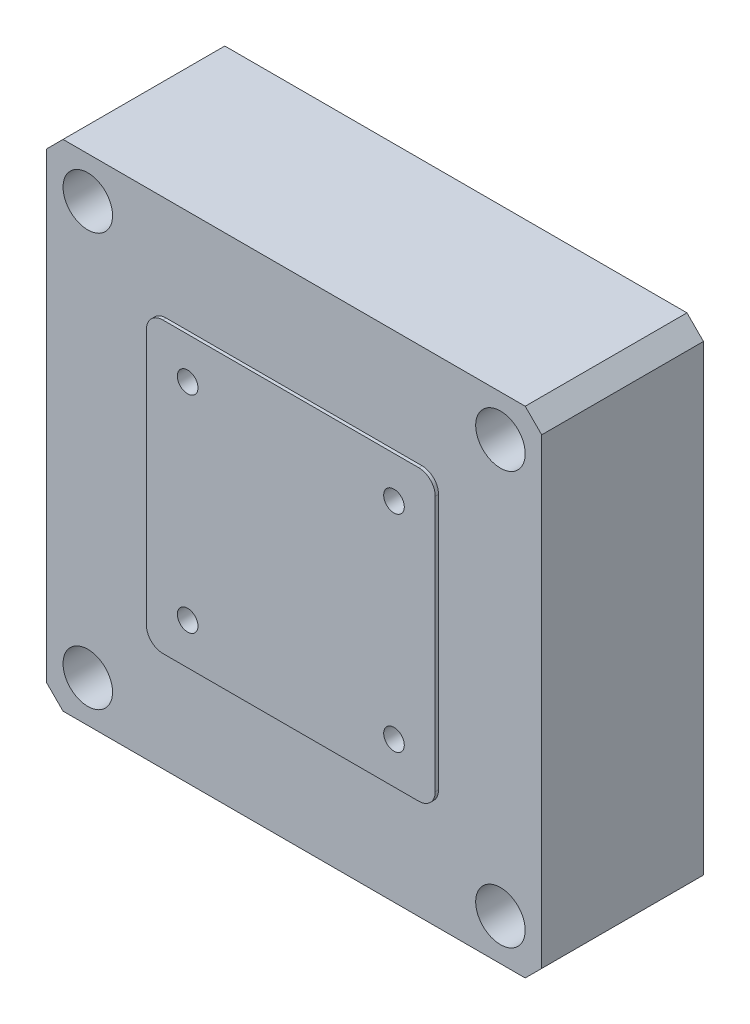
ISO-10303-21;
HEADER;
FILE_DESCRIPTION(('STEP AP214'),'2;1');
FILE_NAME('part.step','',(''),(''),'','','');
FILE_SCHEMA(('AUTOMOTIVE_DESIGN { 1 0 10303 214 1 1 1 1 }'));
ENDSEC;
DATA;
#1=APPLICATION_CONTEXT('core data for automotive mechanical design processes');
#2=APPLICATION_PROTOCOL_DEFINITION('international standard','automotive_design',2000,#1);
#3=PRODUCT_CONTEXT('',#1,'mechanical');
#4=PRODUCT('Part','Part','',(#3));
#5=PRODUCT_RELATED_PRODUCT_CATEGORY('part','',(#4));
#6=PRODUCT_DEFINITION_FORMATION('','',#4);
#7=PRODUCT_DEFINITION_CONTEXT('part definition',#1,'design');
#8=PRODUCT_DEFINITION('design','',#6,#7);
#9=PRODUCT_DEFINITION_SHAPE('','',#8);
#10=(LENGTH_UNIT() NAMED_UNIT(*) SI_UNIT(.MILLI.,.METRE.));
#11=(NAMED_UNIT(*) PLANE_ANGLE_UNIT() SI_UNIT($,.RADIAN.));
#12=(NAMED_UNIT(*) SI_UNIT($,.STERADIAN.) SOLID_ANGLE_UNIT());
#13=UNCERTAINTY_MEASURE_WITH_UNIT(LENGTH_MEASURE(1.E-05),#10,'distance_accuracy_value','');
#14=(GEOMETRIC_REPRESENTATION_CONTEXT(3) GLOBAL_UNCERTAINTY_ASSIGNED_CONTEXT((#13)) GLOBAL_UNIT_ASSIGNED_CONTEXT((#10,
#11,#12)) REPRESENTATION_CONTEXT('',''));
#15=CARTESIAN_POINT('',(0.,0.,0.));
#16=DIRECTION('',(0.,0.,1.));
#17=DIRECTION('',(1.,0.,0.));
#18=AXIS2_PLACEMENT_3D('',#15,#16,#17);
#19=CARTESIAN_POINT('',(30.,30.,19.6));
#20=DIRECTION('',(-1.,0.,0.));
#21=DIRECTION('',(0.,-1.,0.));
#22=AXIS2_PLACEMENT_3D('',#19,#20,#21);
#23=PLANE('',#22);
#24=DIRECTION('',(0.,1.,0.));
#25=VECTOR('',#24,1.);
#26=CARTESIAN_POINT('',(30.,30.,19.6));
#27=LINE('',#26,#25);
#28=CARTESIAN_POINT('',(30.,-28.,19.6));
#29=VERTEX_POINT('',#28);
#30=CARTESIAN_POINT('',(30.,28.,19.6));
#31=VERTEX_POINT('',#30);
#32=EDGE_CURVE('E301',#29,#31,#27,.T.);
#33=ORIENTED_EDGE('',*,*,#32,.F.);
#34=DIRECTION('',(0.,0.,-1.));
#35=VECTOR('',#34,1.);
#36=CARTESIAN_POINT('',(30.,-28.,19.6));
#37=LINE('',#36,#35);
#38=CARTESIAN_POINT('',(30.,-28.,0.));
#39=VERTEX_POINT('',#38);
#40=EDGE_CURVE('E373',#29,#39,#37,.T.);
#41=ORIENTED_EDGE('',*,*,#40,.T.);
#42=DIRECTION('',(0.,1.,0.));
#43=VECTOR('',#42,1.);
#44=CARTESIAN_POINT('',(30.,30.,0.));
#45=LINE('',#44,#43);
#46=CARTESIAN_POINT('',(30.,28.,0.));
#47=VERTEX_POINT('',#46);
#48=EDGE_CURVE('E287',#39,#47,#45,.T.);
#49=ORIENTED_EDGE('',*,*,#48,.T.);
#50=DIRECTION('',(0.,0.,1.));
#51=VECTOR('',#50,1.);
#52=CARTESIAN_POINT('',(30.,28.,19.6));
#53=LINE('',#52,#51);
#54=EDGE_CURVE('E370',#47,#31,#53,.T.);
#55=ORIENTED_EDGE('',*,*,#54,.T.);
#56=EDGE_LOOP('',(#33,#41,#49,#55));
#57=FACE_BOUND('',#56,.T.);
#58=ADVANCED_FACE('F41',(#57),#23,.F.);
#59=CARTESIAN_POINT('',(-30.,30.,19.6));
#60=DIRECTION('',(0.,-1.,0.));
#61=DIRECTION('',(0.,0.,-1.));
#62=AXIS2_PLACEMENT_3D('',#59,#60,#61);
#63=PLANE('',#62);
#64=DIRECTION('',(-1.,0.,0.));
#65=VECTOR('',#64,1.);
#66=CARTESIAN_POINT('',(-30.,30.,19.6));
#67=LINE('',#66,#65);
#68=CARTESIAN_POINT('',(28.,30.,19.6));
#69=VERTEX_POINT('',#68);
#70=CARTESIAN_POINT('',(-28.,30.,19.6));
#71=VERTEX_POINT('',#70);
#72=EDGE_CURVE('E305',#69,#71,#67,.T.);
#73=ORIENTED_EDGE('',*,*,#72,.F.);
#74=DIRECTION('',(0.,0.,-1.));
#75=VECTOR('',#74,1.);
#76=CARTESIAN_POINT('',(28.,30.,19.6));
#77=LINE('',#76,#75);
#78=CARTESIAN_POINT('',(28.,30.,0.));
#79=VERTEX_POINT('',#78);
#80=EDGE_CURVE('E380',#69,#79,#77,.T.);
#81=ORIENTED_EDGE('',*,*,#80,.T.);
#82=DIRECTION('',(-1.,0.,0.));
#83=VECTOR('',#82,1.);
#84=CARTESIAN_POINT('',(-30.,30.,0.));
#85=LINE('',#84,#83);
#86=CARTESIAN_POINT('',(-28.,30.,0.));
#87=VERTEX_POINT('',#86);
#88=EDGE_CURVE('E322',#79,#87,#85,.T.);
#89=ORIENTED_EDGE('',*,*,#88,.T.);
#90=DIRECTION('',(0.,0.,1.));
#91=VECTOR('',#90,1.);
#92=CARTESIAN_POINT('',(-28.,30.,19.6));
#93=LINE('',#92,#91);
#94=EDGE_CURVE('E377',#87,#71,#93,.T.);
#95=ORIENTED_EDGE('',*,*,#94,.T.);
#96=EDGE_LOOP('',(#73,#81,#89,#95));
#97=FACE_BOUND('',#96,.T.);
#98=ADVANCED_FACE('F474',(#97),#63,.F.);
#99=CARTESIAN_POINT('',(-30.,30.,19.6));
#100=DIRECTION('',(1.,0.,0.));
#101=DIRECTION('',(0.,1.,0.));
#102=AXIS2_PLACEMENT_3D('',#99,#100,#101);
#103=PLANE('',#102);
#104=DIRECTION('',(0.,-1.,0.));
#105=VECTOR('',#104,1.);
#106=CARTESIAN_POINT('',(-30.,30.,0.));
#107=LINE('',#106,#105);
#108=CARTESIAN_POINT('',(-30.,28.,0.));
#109=VERTEX_POINT('',#108);
#110=CARTESIAN_POINT('',(-30.,-28.,0.));
#111=VERTEX_POINT('',#110);
#112=EDGE_CURVE('E326',#109,#111,#107,.T.);
#113=ORIENTED_EDGE('',*,*,#112,.T.);
#114=DIRECTION('',(0.,0.,1.));
#115=VECTOR('',#114,1.);
#116=CARTESIAN_POINT('',(-30.,-28.,19.6));
#117=LINE('',#116,#115);
#118=CARTESIAN_POINT('',(-30.,-28.,19.6));
#119=VERTEX_POINT('',#118);
#120=EDGE_CURVE('E355',#111,#119,#117,.T.);
#121=ORIENTED_EDGE('',*,*,#120,.T.);
#122=DIRECTION('',(0.,-1.,0.));
#123=VECTOR('',#122,1.);
#124=CARTESIAN_POINT('',(-30.,30.,19.6));
#125=LINE('',#124,#123);
#126=CARTESIAN_POINT('',(-30.,28.,19.6));
#127=VERTEX_POINT('',#126);
#128=EDGE_CURVE('E310',#127,#119,#125,.T.);
#129=ORIENTED_EDGE('',*,*,#128,.F.);
#130=DIRECTION('',(0.,0.,-1.));
#131=VECTOR('',#130,1.);
#132=CARTESIAN_POINT('',(-30.,28.,19.6));
#133=LINE('',#132,#131);
#134=EDGE_CURVE('E351',#127,#109,#133,.T.);
#135=ORIENTED_EDGE('',*,*,#134,.T.);
#136=EDGE_LOOP('',(#113,#121,#129,#135));
#137=FACE_BOUND('',#136,.T.);
#138=ADVANCED_FACE('F480',(#137),#103,.F.);
#139=CARTESIAN_POINT('',(-30.,-30.,19.6));
#140=DIRECTION('',(0.,1.,0.));
#141=DIRECTION('',(0.,0.,1.));
#142=AXIS2_PLACEMENT_3D('',#139,#140,#141);
#143=PLANE('',#142);
#144=DIRECTION('',(1.,0.,0.));
#145=VECTOR('',#144,1.);
#146=CARTESIAN_POINT('',(-30.,-30.,19.6));
#147=LINE('',#146,#145);
#148=CARTESIAN_POINT('',(-28.,-30.,19.6));
#149=VERTEX_POINT('',#148);
#150=CARTESIAN_POINT('',(28.,-30.,19.6));
#151=VERTEX_POINT('',#150);
#152=EDGE_CURVE('E314',#149,#151,#147,.T.);
#153=ORIENTED_EDGE('',*,*,#152,.F.);
#154=DIRECTION('',(0.,0.,-1.));
#155=VECTOR('',#154,1.);
#156=CARTESIAN_POINT('',(-28.,-30.,19.6));
#157=LINE('',#156,#155);
#158=CARTESIAN_POINT('',(-28.,-30.,0.));
#159=VERTEX_POINT('',#158);
#160=EDGE_CURVE('E335',#149,#159,#157,.T.);
#161=ORIENTED_EDGE('',*,*,#160,.T.);
#162=DIRECTION('',(1.,0.,0.));
#163=VECTOR('',#162,1.);
#164=CARTESIAN_POINT('',(-30.,-30.,0.));
#165=LINE('',#164,#163);
#166=CARTESIAN_POINT('',(28.,-30.,0.));
#167=VERTEX_POINT('',#166);
#168=EDGE_CURVE('E306',#159,#167,#165,.T.);
#169=ORIENTED_EDGE('',*,*,#168,.T.);
#170=DIRECTION('',(0.,0.,1.));
#171=VECTOR('',#170,1.);
#172=CARTESIAN_POINT('',(28.,-30.,19.6));
#173=LINE('',#172,#171);
#174=EDGE_CURVE('E318',#167,#151,#173,.T.);
#175=ORIENTED_EDGE('',*,*,#174,.T.);
#176=EDGE_LOOP('',(#153,#161,#169,#175));
#177=FACE_BOUND('',#176,.T.);
#178=ADVANCED_FACE('F518',(#177),#143,.F.);
#179=CARTESIAN_POINT('',(0.,0.,19.6));
#180=DIRECTION('',(0.,0.,1.));
#181=DIRECTION('',(1.,0.,0.));
#182=AXIS2_PLACEMENT_3D('',#179,#180,#181);
#183=PLANE('',#182);
#184=CARTESIAN_POINT('',(-25.,25.,19.6));
#185=DIRECTION('',(0.,0.,1.));
#186=DIRECTION('',(1.,0.,0.));
#187=AXIS2_PLACEMENT_3D('',#184,#185,#186);
#188=CIRCLE('',#187,3.00000000000001);
#189=CARTESIAN_POINT('',(-22.,25.,19.6));
#190=VERTEX_POINT('',#189);
#191=EDGE_CURVE('E205',#190,#190,#188,.T.);
#192=ORIENTED_EDGE('',*,*,#191,.F.);
#193=EDGE_LOOP('',(#192));
#194=FACE_BOUND('',#193,.T.);
#195=CARTESIAN_POINT('',(25.,25.,19.6));
#196=DIRECTION('',(0.,0.,1.));
#197=DIRECTION('',(1.,0.,0.));
#198=AXIS2_PLACEMENT_3D('',#195,#196,#197);
#199=CIRCLE('',#198,3.00000000000001);
#200=CARTESIAN_POINT('',(28.,25.,19.6));
#201=VERTEX_POINT('',#200);
#202=EDGE_CURVE('E221',#201,#201,#199,.T.);
#203=ORIENTED_EDGE('',*,*,#202,.F.);
#204=EDGE_LOOP('',(#203));
#205=FACE_BOUND('',#204,.T.);
#206=CARTESIAN_POINT('',(-25.,-25.,19.6));
#207=DIRECTION('',(0.,0.,1.));
#208=DIRECTION('',(1.,0.,0.));
#209=AXIS2_PLACEMENT_3D('',#206,#207,#208);
#210=CIRCLE('',#209,3.00000000000001);
#211=CARTESIAN_POINT('',(-22.,-25.,19.6));
#212=VERTEX_POINT('',#211);
#213=EDGE_CURVE('E237',#212,#212,#210,.T.);
#214=ORIENTED_EDGE('',*,*,#213,.F.);
#215=EDGE_LOOP('',(#214));
#216=FACE_BOUND('',#215,.T.);
#217=CARTESIAN_POINT('',(25.,-25.,19.6));
#218=DIRECTION('',(0.,0.,1.));
#219=DIRECTION('',(1.,0.,0.));
#220=AXIS2_PLACEMENT_3D('',#217,#218,#219);
#221=CIRCLE('',#220,3.00000000000001);
#222=CARTESIAN_POINT('',(28.,-25.,19.6));
#223=VERTEX_POINT('',#222);
#224=EDGE_CURVE('E253',#223,#223,#221,.T.);
#225=ORIENTED_EDGE('',*,*,#224,.F.);
#226=EDGE_LOOP('',(#225));
#227=FACE_BOUND('',#226,.T.);
#228=DIRECTION('',(0.,1.,0.));
#229=VECTOR('',#228,1.);
#230=CARTESIAN_POINT('',(17.5,17.5,19.6));
#231=LINE('',#230,#229);
#232=CARTESIAN_POINT('',(17.5,-15.5,19.6));
#233=VERTEX_POINT('',#232);
#234=CARTESIAN_POINT('',(17.5,15.5,19.6));
#235=VERTEX_POINT('',#234);
#236=EDGE_CURVE('E269',#233,#235,#231,.T.);
#237=ORIENTED_EDGE('',*,*,#236,.F.);
#238=CARTESIAN_POINT('',(15.5,-15.5,19.6));
#239=DIRECTION('',(0.,0.,1.));
#240=DIRECTION('',(1.,0.,0.));
#241=AXIS2_PLACEMENT_3D('',#238,#239,#240);
#242=CIRCLE('',#241,2.);
#243=CARTESIAN_POINT('',(15.5,-17.5,19.6));
#244=VERTEX_POINT('',#243);
#245=EDGE_CURVE('E423',#233,#244,#242,.F.);
#246=ORIENTED_EDGE('',*,*,#245,.T.);
#247=DIRECTION('',(1.,0.,0.));
#248=VECTOR('',#247,1.);
#249=CARTESIAN_POINT('',(-17.5,-17.5,19.6));
#250=LINE('',#249,#248);
#251=CARTESIAN_POINT('',(-15.5,-17.5,19.6));
#252=VERTEX_POINT('',#251);
#253=EDGE_CURVE('E275',#252,#244,#250,.T.);
#254=ORIENTED_EDGE('',*,*,#253,.F.);
#255=CARTESIAN_POINT('',(-15.5,-15.5,19.6));
#256=DIRECTION('',(0.,0.,1.));
#257=DIRECTION('',(1.,0.,0.));
#258=AXIS2_PLACEMENT_3D('',#255,#256,#257);
#259=CIRCLE('',#258,2.);
#260=CARTESIAN_POINT('',(-17.5,-15.5,19.6));
#261=VERTEX_POINT('',#260);
#262=EDGE_CURVE('E426',#252,#261,#259,.F.);
#263=ORIENTED_EDGE('',*,*,#262,.T.);
#264=DIRECTION('',(0.,-1.,0.));
#265=VECTOR('',#264,1.);
#266=CARTESIAN_POINT('',(-17.5,17.5,19.6));
#267=LINE('',#266,#265);
#268=CARTESIAN_POINT('',(-17.5,15.5,19.6));
#269=VERTEX_POINT('',#268);
#270=EDGE_CURVE('E294',#269,#261,#267,.T.);
#271=ORIENTED_EDGE('',*,*,#270,.F.);
#272=CARTESIAN_POINT('',(-15.5,15.5,19.6));
#273=DIRECTION('',(0.,0.,1.));
#274=DIRECTION('',(1.,0.,0.));
#275=AXIS2_PLACEMENT_3D('',#272,#273,#274);
#276=CIRCLE('',#275,2.);
#277=CARTESIAN_POINT('',(-15.5,17.5,19.6));
#278=VERTEX_POINT('',#277);
#279=EDGE_CURVE('E11',#269,#278,#276,.F.);
#280=ORIENTED_EDGE('',*,*,#279,.T.);
#281=DIRECTION('',(-1.,0.,0.));
#282=VECTOR('',#281,1.);
#283=CARTESIAN_POINT('',(-17.5,17.5,19.6));
#284=LINE('',#283,#282);
#285=CARTESIAN_POINT('',(15.5,17.5,19.6));
#286=VERTEX_POINT('',#285);
#287=EDGE_CURVE('E291',#286,#278,#284,.T.);
#288=ORIENTED_EDGE('',*,*,#287,.F.);
#289=CARTESIAN_POINT('',(15.5,15.5,19.6));
#290=DIRECTION('',(0.,0.,1.));
#291=DIRECTION('',(1.,0.,0.));
#292=AXIS2_PLACEMENT_3D('',#289,#290,#291);
#293=CIRCLE('',#292,2.);
#294=EDGE_CURVE('E50',#286,#235,#293,.F.);
#295=ORIENTED_EDGE('',*,*,#294,.T.);
#296=EDGE_LOOP('',(#237,#246,#254,#263,#271,#280,#288,#295));
#297=FACE_BOUND('',#296,.T.);
#298=ORIENTED_EDGE('',*,*,#128,.T.);
#299=DIRECTION('',(-0.707106781186545,0.70710678118655,0.));
#300=VECTOR('',#299,1.);
#301=CARTESIAN_POINT('',(-29.0000000000001,-28.9999999999999,19.6));
#302=LINE('',#301,#300);
#303=EDGE_CURVE('E367',#119,#149,#302,.F.);
#304=ORIENTED_EDGE('',*,*,#303,.T.);
#305=ORIENTED_EDGE('',*,*,#152,.T.);
#306=DIRECTION('',(-0.707106781186548,-0.707106781186547,0.));
#307=VECTOR('',#306,1.);
#308=CARTESIAN_POINT('',(29.,-29.,19.6));
#309=LINE('',#308,#307);
#310=EDGE_CURVE('E364',#151,#29,#309,.F.);
#311=ORIENTED_EDGE('',*,*,#310,.T.);
#312=ORIENTED_EDGE('',*,*,#32,.T.);
#313=DIRECTION('',(0.707106781186545,-0.70710678118655,0.));
#314=VECTOR('',#313,1.);
#315=CARTESIAN_POINT('',(29.0000000000001,28.9999999999999,19.6));
#316=LINE('',#315,#314);
#317=EDGE_CURVE('E361',#31,#69,#316,.F.);
#318=ORIENTED_EDGE('',*,*,#317,.T.);
#319=ORIENTED_EDGE('',*,*,#72,.T.);
#320=DIRECTION('',(0.70710678118655,0.707106781186545,0.));
#321=VECTOR('',#320,1.);
#322=CARTESIAN_POINT('',(-28.9999999999999,29.0000000000001,19.6));
#323=LINE('',#322,#321);
#324=EDGE_CURVE('E358',#71,#127,#323,.F.);
#325=ORIENTED_EDGE('',*,*,#324,.T.);
#326=EDGE_LOOP('',(#298,#304,#305,#311,#312,#318,#319,#325));
#327=FACE_BOUND('',#326,.T.);
#328=ADVANCED_FACE('F430',(#194,#205,#216,#227,#297,#327),#183,.T.);
#329=CARTESIAN_POINT('',(0.,0.,0.));
#330=DIRECTION('',(0.,0.,1.));
#331=DIRECTION('',(1.,0.,0.));
#332=AXIS2_PLACEMENT_3D('',#329,#330,#331);
#333=PLANE('',#332);
#334=CARTESIAN_POINT('',(-25.,25.,0.));
#335=DIRECTION('',(0.,0.,1.));
#336=DIRECTION('',(1.,0.,0.));
#337=AXIS2_PLACEMENT_3D('',#334,#335,#336);
#338=CIRCLE('',#337,1.70000000000001);
#339=CARTESIAN_POINT('',(-23.3,25.,0.));
#340=VERTEX_POINT('',#339);
#341=EDGE_CURVE('E217',#340,#340,#338,.T.);
#342=ORIENTED_EDGE('',*,*,#341,.T.);
#343=EDGE_LOOP('',(#342));
#344=FACE_BOUND('',#343,.T.);
#345=CARTESIAN_POINT('',(25.,25.,0.));
#346=DIRECTION('',(0.,0.,1.));
#347=DIRECTION('',(1.,0.,0.));
#348=AXIS2_PLACEMENT_3D('',#345,#346,#347);
#349=CIRCLE('',#348,1.70000000000001);
#350=CARTESIAN_POINT('',(26.7,25.,0.));
#351=VERTEX_POINT('',#350);
#352=EDGE_CURVE('E233',#351,#351,#349,.T.);
#353=ORIENTED_EDGE('',*,*,#352,.T.);
#354=EDGE_LOOP('',(#353));
#355=FACE_BOUND('',#354,.T.);
#356=CARTESIAN_POINT('',(-25.,-25.,0.));
#357=DIRECTION('',(0.,0.,1.));
#358=DIRECTION('',(1.,0.,0.));
#359=AXIS2_PLACEMENT_3D('',#356,#357,#358);
#360=CIRCLE('',#359,1.70000000000001);
#361=CARTESIAN_POINT('',(-23.3,-25.,0.));
#362=VERTEX_POINT('',#361);
#363=EDGE_CURVE('E249',#362,#362,#360,.T.);
#364=ORIENTED_EDGE('',*,*,#363,.T.);
#365=EDGE_LOOP('',(#364));
#366=FACE_BOUND('',#365,.T.);
#367=CARTESIAN_POINT('',(25.,-25.,0.));
#368=DIRECTION('',(0.,0.,1.));
#369=DIRECTION('',(1.,0.,0.));
#370=AXIS2_PLACEMENT_3D('',#367,#368,#369);
#371=CIRCLE('',#370,1.70000000000001);
#372=CARTESIAN_POINT('',(26.7,-25.,0.));
#373=VERTEX_POINT('',#372);
#374=EDGE_CURVE('E265',#373,#373,#371,.T.);
#375=ORIENTED_EDGE('',*,*,#374,.T.);
#376=EDGE_LOOP('',(#375));
#377=FACE_BOUND('',#376,.T.);
#378=ORIENTED_EDGE('',*,*,#168,.F.);
#379=DIRECTION('',(0.707106781186545,-0.70710678118655,0.));
#380=VECTOR('',#379,1.);
#381=CARTESIAN_POINT('',(-28.,-30.,0.));
#382=LINE('',#381,#380);
#383=EDGE_CURVE('E348',#159,#111,#382,.F.);
#384=ORIENTED_EDGE('',*,*,#383,.T.);
#385=ORIENTED_EDGE('',*,*,#112,.F.);
#386=DIRECTION('',(-0.70710678118655,-0.707106781186545,0.));
#387=VECTOR('',#386,1.);
#388=CARTESIAN_POINT('',(-30.,28.,0.));
#389=LINE('',#388,#387);
#390=EDGE_CURVE('E339',#109,#87,#389,.F.);
#391=ORIENTED_EDGE('',*,*,#390,.T.);
#392=ORIENTED_EDGE('',*,*,#88,.F.);
#393=DIRECTION('',(-0.707106781186545,0.70710678118655,0.));
#394=VECTOR('',#393,1.);
#395=CARTESIAN_POINT('',(28.,30.,0.));
#396=LINE('',#395,#394);
#397=EDGE_CURVE('E342',#79,#47,#396,.F.);
#398=ORIENTED_EDGE('',*,*,#397,.T.);
#399=ORIENTED_EDGE('',*,*,#48,.F.);
#400=DIRECTION('',(0.707106781186548,0.707106781186547,0.));
#401=VECTOR('',#400,1.);
#402=CARTESIAN_POINT('',(30.,-28.,0.));
#403=LINE('',#402,#401);
#404=EDGE_CURVE('E345',#39,#167,#403,.F.);
#405=ORIENTED_EDGE('',*,*,#404,.T.);
#406=EDGE_LOOP('',(#378,#384,#385,#391,#392,#398,#399,#405));
#407=FACE_BOUND('',#406,.T.);
#408=ADVANCED_FACE('F490',(#344,#355,#366,#377,#407),#333,.F.);
#409=CARTESIAN_POINT('',(-28.,-30.,19.6));
#410=DIRECTION('',(0.70710678118655,0.707106781186545,0.));
#411=DIRECTION('',(0.,0.,-1.));
#412=AXIS2_PLACEMENT_3D('',#409,#410,#411);
#413=PLANE('',#412);
#414=ORIENTED_EDGE('',*,*,#303,.F.);
#415=ORIENTED_EDGE('',*,*,#120,.F.);
#416=ORIENTED_EDGE('',*,*,#383,.F.);
#417=ORIENTED_EDGE('',*,*,#160,.F.);
#418=EDGE_LOOP('',(#414,#415,#416,#417));
#419=FACE_BOUND('',#418,.T.);
#420=ADVANCED_FACE('F486',(#419),#413,.F.);
#421=CARTESIAN_POINT('',(30.,-28.,19.6));
#422=DIRECTION('',(-0.707106781186547,0.707106781186548,0.));
#423=DIRECTION('',(0.,0.,-1.));
#424=AXIS2_PLACEMENT_3D('',#421,#422,#423);
#425=PLANE('',#424);
#426=ORIENTED_EDGE('',*,*,#310,.F.);
#427=ORIENTED_EDGE('',*,*,#174,.F.);
#428=ORIENTED_EDGE('',*,*,#404,.F.);
#429=ORIENTED_EDGE('',*,*,#40,.F.);
#430=EDGE_LOOP('',(#426,#427,#428,#429));
#431=FACE_BOUND('',#430,.T.);
#432=ADVANCED_FACE('F489',(#431),#425,.F.);
#433=CARTESIAN_POINT('',(28.,30.,19.6));
#434=DIRECTION('',(-0.70710678118655,-0.707106781186545,0.));
#435=DIRECTION('',(0.,0.,-1.));
#436=AXIS2_PLACEMENT_3D('',#433,#434,#435);
#437=PLANE('',#436);
#438=ORIENTED_EDGE('',*,*,#317,.F.);
#439=ORIENTED_EDGE('',*,*,#54,.F.);
#440=ORIENTED_EDGE('',*,*,#397,.F.);
#441=ORIENTED_EDGE('',*,*,#80,.F.);
#442=EDGE_LOOP('',(#438,#439,#440,#441));
#443=FACE_BOUND('',#442,.T.);
#444=ADVANCED_FACE('F494',(#443),#437,.F.);
#445=CARTESIAN_POINT('',(-30.,28.,19.6));
#446=DIRECTION('',(0.707106781186545,-0.70710678118655,0.));
#447=DIRECTION('',(0.,0.,-1.));
#448=AXIS2_PLACEMENT_3D('',#445,#446,#447);
#449=PLANE('',#448);
#450=ORIENTED_EDGE('',*,*,#324,.F.);
#451=ORIENTED_EDGE('',*,*,#94,.F.);
#452=ORIENTED_EDGE('',*,*,#390,.F.);
#453=ORIENTED_EDGE('',*,*,#134,.F.);
#454=EDGE_LOOP('',(#450,#451,#452,#453));
#455=FACE_BOUND('',#454,.T.);
#456=ADVANCED_FACE('F497',(#455),#449,.F.);
#457=CARTESIAN_POINT('',(17.5,17.5,20.));
#458=DIRECTION('',(-1.,0.,0.));
#459=DIRECTION('',(0.,-1.,0.));
#460=AXIS2_PLACEMENT_3D('',#457,#458,#459);
#461=PLANE('',#460);
#462=DIRECTION('',(0.,1.,0.));
#463=VECTOR('',#462,1.);
#464=CARTESIAN_POINT('',(17.5,17.5,20.));
#465=LINE('',#464,#463);
#466=CARTESIAN_POINT('',(17.5,-15.5,20.));
#467=VERTEX_POINT('',#466);
#468=CARTESIAN_POINT('',(17.5,15.5,20.));
#469=VERTEX_POINT('',#468);
#470=EDGE_CURVE('E270',#467,#469,#465,.T.);
#471=ORIENTED_EDGE('',*,*,#470,.F.);
#472=DIRECTION('',(0.,0.,-1.));
#473=VECTOR('',#472,1.);
#474=CARTESIAN_POINT('',(17.5,-15.5,20.));
#475=LINE('',#474,#473);
#476=EDGE_CURVE('E387',#467,#233,#475,.T.);
#477=ORIENTED_EDGE('',*,*,#476,.T.);
#478=ORIENTED_EDGE('',*,*,#236,.T.);
#479=DIRECTION('',(0.,0.,-1.));
#480=VECTOR('',#479,1.);
#481=CARTESIAN_POINT('',(17.5,15.5,20.));
#482=LINE('',#481,#480);
#483=EDGE_CURVE('E384',#235,#469,#482,.F.);
#484=ORIENTED_EDGE('',*,*,#483,.T.);
#485=EDGE_LOOP('',(#471,#477,#478,#484));
#486=FACE_BOUND('',#485,.T.);
#487=ADVANCED_FACE('F434',(#486),#461,.F.);
#488=CARTESIAN_POINT('',(-17.5,17.5,20.));
#489=DIRECTION('',(0.,-1.,0.));
#490=DIRECTION('',(0.,0.,-1.));
#491=AXIS2_PLACEMENT_3D('',#488,#489,#490);
#492=PLANE('',#491);
#493=DIRECTION('',(-1.,0.,0.));
#494=VECTOR('',#493,1.);
#495=CARTESIAN_POINT('',(-17.5,17.5,20.));
#496=LINE('',#495,#494);
#497=CARTESIAN_POINT('',(15.5,17.5,20.));
#498=VERTEX_POINT('',#497);
#499=CARTESIAN_POINT('',(-15.5,17.5,20.));
#500=VERTEX_POINT('',#499);
#501=EDGE_CURVE('E274',#498,#500,#496,.T.);
#502=ORIENTED_EDGE('',*,*,#501,.F.);
#503=DIRECTION('',(0.,0.,-1.));
#504=VECTOR('',#503,1.);
#505=CARTESIAN_POINT('',(15.5,17.5,20.));
#506=LINE('',#505,#504);
#507=EDGE_CURVE('E420',#498,#286,#506,.T.);
#508=ORIENTED_EDGE('',*,*,#507,.T.);
#509=ORIENTED_EDGE('',*,*,#287,.T.);
#510=DIRECTION('',(0.,0.,-1.));
#511=VECTOR('',#510,1.);
#512=CARTESIAN_POINT('',(-15.5,17.5,20.));
#513=LINE('',#512,#511);
#514=EDGE_CURVE('E417',#278,#500,#513,.F.);
#515=ORIENTED_EDGE('',*,*,#514,.T.);
#516=EDGE_LOOP('',(#502,#508,#509,#515));
#517=FACE_BOUND('',#516,.T.);
#518=ADVANCED_FACE('F443',(#517),#492,.F.);
#519=CARTESIAN_POINT('',(-17.5,17.5,20.));
#520=DIRECTION('',(1.,0.,0.));
#521=DIRECTION('',(0.,1.,0.));
#522=AXIS2_PLACEMENT_3D('',#519,#520,#521);
#523=PLANE('',#522);
#524=ORIENTED_EDGE('',*,*,#270,.T.);
#525=DIRECTION('',(0.,0.,-1.));
#526=VECTOR('',#525,1.);
#527=CARTESIAN_POINT('',(-17.5,-15.5,20.));
#528=LINE('',#527,#526);
#529=CARTESIAN_POINT('',(-17.5,-15.5,20.));
#530=VERTEX_POINT('',#529);
#531=EDGE_CURVE('E414',#261,#530,#528,.F.);
#532=ORIENTED_EDGE('',*,*,#531,.T.);
#533=DIRECTION('',(0.,-1.,0.));
#534=VECTOR('',#533,1.);
#535=CARTESIAN_POINT('',(-17.5,17.5,20.));
#536=LINE('',#535,#534);
#537=CARTESIAN_POINT('',(-17.5,15.5,20.));
#538=VERTEX_POINT('',#537);
#539=EDGE_CURVE('E279',#538,#530,#536,.T.);
#540=ORIENTED_EDGE('',*,*,#539,.F.);
#541=DIRECTION('',(0.,0.,-1.));
#542=VECTOR('',#541,1.);
#543=CARTESIAN_POINT('',(-17.5,15.5,20.));
#544=LINE('',#543,#542);
#545=EDGE_CURVE('E410',#538,#269,#544,.T.);
#546=ORIENTED_EDGE('',*,*,#545,.T.);
#547=EDGE_LOOP('',(#524,#532,#540,#546));
#548=FACE_BOUND('',#547,.T.);
#549=ADVANCED_FACE('F450',(#548),#523,.F.);
#550=CARTESIAN_POINT('',(-17.5,-17.5,20.));
#551=DIRECTION('',(0.,1.,0.));
#552=DIRECTION('',(0.,0.,1.));
#553=AXIS2_PLACEMENT_3D('',#550,#551,#552);
#554=PLANE('',#553);
#555=ORIENTED_EDGE('',*,*,#253,.T.);
#556=DIRECTION('',(0.,0.,-1.));
#557=VECTOR('',#556,1.);
#558=CARTESIAN_POINT('',(15.5,-17.5,20.));
#559=LINE('',#558,#557);
#560=CARTESIAN_POINT('',(15.5,-17.5,20.));
#561=VERTEX_POINT('',#560);
#562=EDGE_CURVE('E395',#244,#561,#559,.F.);
#563=ORIENTED_EDGE('',*,*,#562,.T.);
#564=DIRECTION('',(1.,0.,0.));
#565=VECTOR('',#564,1.);
#566=CARTESIAN_POINT('',(-17.5,-17.5,20.));
#567=LINE('',#566,#565);
#568=CARTESIAN_POINT('',(-15.5,-17.5,20.));
#569=VERTEX_POINT('',#568);
#570=EDGE_CURVE('E283',#569,#561,#567,.T.);
#571=ORIENTED_EDGE('',*,*,#570,.F.);
#572=DIRECTION('',(0.,0.,-1.));
#573=VECTOR('',#572,1.);
#574=CARTESIAN_POINT('',(-15.5,-17.5,20.));
#575=LINE('',#574,#573);
#576=EDGE_CURVE('E391',#569,#252,#575,.T.);
#577=ORIENTED_EDGE('',*,*,#576,.T.);
#578=EDGE_LOOP('',(#555,#563,#571,#577));
#579=FACE_BOUND('',#578,.T.);
#580=ADVANCED_FACE('F458',(#579),#554,.F.);
#581=CARTESIAN_POINT('',(0.,0.,20.));
#582=DIRECTION('',(0.,0.,1.));
#583=DIRECTION('',(1.,0.,0.));
#584=AXIS2_PLACEMENT_3D('',#581,#582,#583);
#585=PLANE('',#584);
#586=CARTESIAN_POINT('',(-12.5,12.5,20.));
#587=DIRECTION('',(0.,0.,1.));
#588=DIRECTION('',(1.,0.,0.));
#589=AXIS2_PLACEMENT_3D('',#586,#587,#588);
#590=CIRCLE('',#589,1.25);
#591=CARTESIAN_POINT('',(-11.25,12.5,20.));
#592=VERTEX_POINT('',#591);
#593=EDGE_CURVE('E176',#592,#592,#590,.T.);
#594=ORIENTED_EDGE('',*,*,#593,.F.);
#595=EDGE_LOOP('',(#594));
#596=FACE_BOUND('',#595,.T.);
#597=CARTESIAN_POINT('',(12.5,12.5,20.));
#598=DIRECTION('',(0.,0.,1.));
#599=DIRECTION('',(1.,0.,0.));
#600=AXIS2_PLACEMENT_3D('',#597,#598,#599);
#601=CIRCLE('',#600,1.25);
#602=CARTESIAN_POINT('',(13.75,12.5,20.));
#603=VERTEX_POINT('',#602);
#604=EDGE_CURVE('E175',#603,#603,#601,.T.);
#605=ORIENTED_EDGE('',*,*,#604,.F.);
#606=EDGE_LOOP('',(#605));
#607=FACE_BOUND('',#606,.T.);
#608=CARTESIAN_POINT('',(12.5,-12.5,20.));
#609=DIRECTION('',(0.,0.,1.));
#610=DIRECTION('',(1.,0.,0.));
#611=AXIS2_PLACEMENT_3D('',#608,#609,#610);
#612=CIRCLE('',#611,1.25);
#613=CARTESIAN_POINT('',(13.75,-12.5,20.));
#614=VERTEX_POINT('',#613);
#615=EDGE_CURVE('E189',#614,#614,#612,.T.);
#616=ORIENTED_EDGE('',*,*,#615,.F.);
#617=EDGE_LOOP('',(#616));
#618=FACE_BOUND('',#617,.T.);
#619=CARTESIAN_POINT('',(-12.5,-12.5,20.));
#620=DIRECTION('',(0.,0.,1.));
#621=DIRECTION('',(1.,0.,0.));
#622=AXIS2_PLACEMENT_3D('',#619,#620,#621);
#623=CIRCLE('',#622,1.25);
#624=CARTESIAN_POINT('',(-11.25,-12.5,20.));
#625=VERTEX_POINT('',#624);
#626=EDGE_CURVE('E197',#625,#625,#623,.T.);
#627=ORIENTED_EDGE('',*,*,#626,.F.);
#628=EDGE_LOOP('',(#627));
#629=FACE_BOUND('',#628,.T.);
#630=ORIENTED_EDGE('',*,*,#570,.T.);
#631=CARTESIAN_POINT('',(15.5,-15.5,20.));
#632=DIRECTION('',(0.,0.,1.));
#633=DIRECTION('',(1.,0.,0.));
#634=AXIS2_PLACEMENT_3D('',#631,#632,#633);
#635=CIRCLE('',#634,2.);
#636=EDGE_CURVE('E407',#561,#467,#635,.T.);
#637=ORIENTED_EDGE('',*,*,#636,.T.);
#638=ORIENTED_EDGE('',*,*,#470,.T.);
#639=CARTESIAN_POINT('',(15.5,15.5,20.));
#640=DIRECTION('',(0.,0.,1.));
#641=DIRECTION('',(1.,0.,0.));
#642=AXIS2_PLACEMENT_3D('',#639,#640,#641);
#643=CIRCLE('',#642,2.);
#644=EDGE_CURVE('E401',#469,#498,#643,.T.);
#645=ORIENTED_EDGE('',*,*,#644,.T.);
#646=ORIENTED_EDGE('',*,*,#501,.T.);
#647=CARTESIAN_POINT('',(-15.5,15.5,20.));
#648=DIRECTION('',(0.,0.,1.));
#649=DIRECTION('',(1.,0.,0.));
#650=AXIS2_PLACEMENT_3D('',#647,#648,#649);
#651=CIRCLE('',#650,2.);
#652=EDGE_CURVE('E398',#500,#538,#651,.T.);
#653=ORIENTED_EDGE('',*,*,#652,.T.);
#654=ORIENTED_EDGE('',*,*,#539,.T.);
#655=CARTESIAN_POINT('',(-15.5,-15.5,20.));
#656=DIRECTION('',(0.,0.,1.));
#657=DIRECTION('',(1.,0.,0.));
#658=AXIS2_PLACEMENT_3D('',#655,#656,#657);
#659=CIRCLE('',#658,2.);
#660=EDGE_CURVE('E404',#530,#569,#659,.T.);
#661=ORIENTED_EDGE('',*,*,#660,.T.);
#662=EDGE_LOOP('',(#630,#637,#638,#645,#646,#653,#654,#661));
#663=FACE_BOUND('',#662,.T.);
#664=ADVANCED_FACE('F440',(#596,#607,#618,#629,#663),#585,.T.);
#665=CARTESIAN_POINT('',(15.5,-15.5,20.));
#666=DIRECTION('',(0.,0.,-1.));
#667=DIRECTION('',(-1.,0.,0.));
#668=AXIS2_PLACEMENT_3D('',#665,#666,#667);
#669=CYLINDRICAL_SURFACE('',#668,2.);
#670=ORIENTED_EDGE('',*,*,#636,.F.);
#671=ORIENTED_EDGE('',*,*,#562,.F.);
#672=ORIENTED_EDGE('',*,*,#245,.F.);
#673=ORIENTED_EDGE('',*,*,#476,.F.);
#674=EDGE_LOOP('',(#670,#671,#672,#673));
#675=FACE_BOUND('',#674,.T.);
#676=ADVANCED_FACE('F462',(#675),#669,.T.);
#677=CARTESIAN_POINT('',(-15.5,-15.5,20.));
#678=DIRECTION('',(0.,0.,-1.));
#679=DIRECTION('',(-1.,0.,0.));
#680=AXIS2_PLACEMENT_3D('',#677,#678,#679);
#681=CYLINDRICAL_SURFACE('',#680,2.);
#682=ORIENTED_EDGE('',*,*,#660,.F.);
#683=ORIENTED_EDGE('',*,*,#531,.F.);
#684=ORIENTED_EDGE('',*,*,#262,.F.);
#685=ORIENTED_EDGE('',*,*,#576,.F.);
#686=EDGE_LOOP('',(#682,#683,#684,#685));
#687=FACE_BOUND('',#686,.T.);
#688=ADVANCED_FACE('F453',(#687),#681,.T.);
#689=CARTESIAN_POINT('',(15.5,15.5,20.));
#690=DIRECTION('',(0.,0.,-1.));
#691=DIRECTION('',(-1.,0.,0.));
#692=AXIS2_PLACEMENT_3D('',#689,#690,#691);
#693=CYLINDRICAL_SURFACE('',#692,2.);
#694=ORIENTED_EDGE('',*,*,#644,.F.);
#695=ORIENTED_EDGE('',*,*,#483,.F.);
#696=ORIENTED_EDGE('',*,*,#294,.F.);
#697=ORIENTED_EDGE('',*,*,#507,.F.);
#698=EDGE_LOOP('',(#694,#695,#696,#697));
#699=FACE_BOUND('',#698,.T.);
#700=ADVANCED_FACE('F437',(#699),#693,.T.);
#701=CARTESIAN_POINT('',(-15.5,15.5,20.));
#702=DIRECTION('',(0.,0.,-1.));
#703=DIRECTION('',(-1.,0.,0.));
#704=AXIS2_PLACEMENT_3D('',#701,#702,#703);
#705=CYLINDRICAL_SURFACE('',#704,2.);
#706=ORIENTED_EDGE('',*,*,#652,.F.);
#707=ORIENTED_EDGE('',*,*,#514,.F.);
#708=ORIENTED_EDGE('',*,*,#279,.F.);
#709=ORIENTED_EDGE('',*,*,#545,.F.);
#710=EDGE_LOOP('',(#706,#707,#708,#709));
#711=FACE_BOUND('',#710,.T.);
#712=ADVANCED_FACE('F43',(#711),#705,.T.);
#713=CARTESIAN_POINT('',(25.,-25.,19.6));
#714=DIRECTION('',(0.,0.,1.));
#715=DIRECTION('',(1.,0.,0.));
#716=AXIS2_PLACEMENT_3D('',#713,#714,#715);
#717=CYLINDRICAL_SURFACE('',#716,1.70000000000001);
#718=ORIENTED_EDGE('',*,*,#374,.F.);
#719=EDGE_LOOP('',(#718));
#720=FACE_BOUND('',#719,.T.);
#721=CARTESIAN_POINT('',(25.,-25.,14.6));
#722=DIRECTION('',(0.,0.,1.));
#723=DIRECTION('',(1.,0.,0.));
#724=AXIS2_PLACEMENT_3D('',#721,#722,#723);
#725=CIRCLE('',#724,1.70000000000001);
#726=CARTESIAN_POINT('',(26.7,-25.,14.6));
#727=VERTEX_POINT('',#726);
#728=EDGE_CURVE('E261',#727,#727,#725,.T.);
#729=ORIENTED_EDGE('',*,*,#728,.T.);
#730=EDGE_LOOP('',(#729));
#731=FACE_BOUND('',#730,.T.);
#732=ADVANCED_FACE('F568',(#720,#731),#717,.F.);
#733=CARTESIAN_POINT('',(26.7,-25.,14.6));
#734=DIRECTION('',(0.,0.,-1.));
#735=DIRECTION('',(-1.,0.,0.));
#736=AXIS2_PLACEMENT_3D('',#733,#734,#735);
#737=PLANE('',#736);
#738=ORIENTED_EDGE('',*,*,#728,.F.);
#739=EDGE_LOOP('',(#738));
#740=FACE_BOUND('',#739,.T.);
#741=CARTESIAN_POINT('',(25.,-25.,14.6));
#742=DIRECTION('',(0.,0.,1.));
#743=DIRECTION('',(1.,0.,0.));
#744=AXIS2_PLACEMENT_3D('',#741,#742,#743);
#745=CIRCLE('',#744,3.00000000000001);
#746=CARTESIAN_POINT('',(28.,-25.,14.6));
#747=VERTEX_POINT('',#746);
#748=EDGE_CURVE('E257',#747,#747,#745,.T.);
#749=ORIENTED_EDGE('',*,*,#748,.T.);
#750=EDGE_LOOP('',(#749));
#751=FACE_BOUND('',#750,.T.);
#752=ADVANCED_FACE('F573',(#740,#751),#737,.F.);
#753=CARTESIAN_POINT('',(25.,-25.,19.6));
#754=DIRECTION('',(0.,0.,1.));
#755=DIRECTION('',(1.,0.,0.));
#756=AXIS2_PLACEMENT_3D('',#753,#754,#755);
#757=CYLINDRICAL_SURFACE('',#756,3.00000000000001);
#758=ORIENTED_EDGE('',*,*,#748,.F.);
#759=EDGE_LOOP('',(#758));
#760=FACE_BOUND('',#759,.T.);
#761=ORIENTED_EDGE('',*,*,#224,.T.);
#762=EDGE_LOOP('',(#761));
#763=FACE_BOUND('',#762,.T.);
#764=ADVANCED_FACE('F583',(#760,#763),#757,.F.);
#765=CARTESIAN_POINT('',(-25.,-25.,19.6));
#766=DIRECTION('',(0.,0.,1.));
#767=DIRECTION('',(1.,0.,0.));
#768=AXIS2_PLACEMENT_3D('',#765,#766,#767);
#769=CYLINDRICAL_SURFACE('',#768,1.70000000000001);
#770=ORIENTED_EDGE('',*,*,#363,.F.);
#771=EDGE_LOOP('',(#770));
#772=FACE_BOUND('',#771,.T.);
#773=CARTESIAN_POINT('',(-25.,-25.,14.6));
#774=DIRECTION('',(0.,0.,1.));
#775=DIRECTION('',(1.,0.,0.));
#776=AXIS2_PLACEMENT_3D('',#773,#774,#775);
#777=CIRCLE('',#776,1.70000000000001);
#778=CARTESIAN_POINT('',(-23.3,-25.,14.6));
#779=VERTEX_POINT('',#778);
#780=EDGE_CURVE('E245',#779,#779,#777,.T.);
#781=ORIENTED_EDGE('',*,*,#780,.T.);
#782=EDGE_LOOP('',(#781));
#783=FACE_BOUND('',#782,.T.);
#784=ADVANCED_FACE('F593',(#772,#783),#769,.F.);
#785=CARTESIAN_POINT('',(-23.3,-25.,14.6));
#786=DIRECTION('',(0.,0.,-1.));
#787=DIRECTION('',(-1.,0.,0.));
#788=AXIS2_PLACEMENT_3D('',#785,#786,#787);
#789=PLANE('',#788);
#790=ORIENTED_EDGE('',*,*,#780,.F.);
#791=EDGE_LOOP('',(#790));
#792=FACE_BOUND('',#791,.T.);
#793=CARTESIAN_POINT('',(-25.,-25.,14.6));
#794=DIRECTION('',(0.,0.,1.));
#795=DIRECTION('',(1.,0.,0.));
#796=AXIS2_PLACEMENT_3D('',#793,#794,#795);
#797=CIRCLE('',#796,3.00000000000001);
#798=CARTESIAN_POINT('',(-22.,-25.,14.6));
#799=VERTEX_POINT('',#798);
#800=EDGE_CURVE('E241',#799,#799,#797,.T.);
#801=ORIENTED_EDGE('',*,*,#800,.T.);
#802=EDGE_LOOP('',(#801));
#803=FACE_BOUND('',#802,.T.);
#804=ADVANCED_FACE('F603',(#792,#803),#789,.F.);
#805=CARTESIAN_POINT('',(-25.,-25.,19.6));
#806=DIRECTION('',(0.,0.,1.));
#807=DIRECTION('',(1.,0.,0.));
#808=AXIS2_PLACEMENT_3D('',#805,#806,#807);
#809=CYLINDRICAL_SURFACE('',#808,3.00000000000001);
#810=ORIENTED_EDGE('',*,*,#800,.F.);
#811=EDGE_LOOP('',(#810));
#812=FACE_BOUND('',#811,.T.);
#813=ORIENTED_EDGE('',*,*,#213,.T.);
#814=EDGE_LOOP('',(#813));
#815=FACE_BOUND('',#814,.T.);
#816=ADVANCED_FACE('F613',(#812,#815),#809,.F.);
#817=CARTESIAN_POINT('',(25.,25.,19.6));
#818=DIRECTION('',(0.,0.,1.));
#819=DIRECTION('',(1.,0.,0.));
#820=AXIS2_PLACEMENT_3D('',#817,#818,#819);
#821=CYLINDRICAL_SURFACE('',#820,1.70000000000001);
#822=ORIENTED_EDGE('',*,*,#352,.F.);
#823=EDGE_LOOP('',(#822));
#824=FACE_BOUND('',#823,.T.);
#825=CARTESIAN_POINT('',(25.,25.,14.6));
#826=DIRECTION('',(0.,0.,1.));
#827=DIRECTION('',(1.,0.,0.));
#828=AXIS2_PLACEMENT_3D('',#825,#826,#827);
#829=CIRCLE('',#828,1.70000000000001);
#830=CARTESIAN_POINT('',(26.7,25.,14.6));
#831=VERTEX_POINT('',#830);
#832=EDGE_CURVE('E229',#831,#831,#829,.T.);
#833=ORIENTED_EDGE('',*,*,#832,.T.);
#834=EDGE_LOOP('',(#833));
#835=FACE_BOUND('',#834,.T.);
#836=ADVANCED_FACE('F623',(#824,#835),#821,.F.);
#837=CARTESIAN_POINT('',(26.7,25.,14.6));
#838=DIRECTION('',(0.,0.,-1.));
#839=DIRECTION('',(-1.,0.,0.));
#840=AXIS2_PLACEMENT_3D('',#837,#838,#839);
#841=PLANE('',#840);
#842=ORIENTED_EDGE('',*,*,#832,.F.);
#843=EDGE_LOOP('',(#842));
#844=FACE_BOUND('',#843,.T.);
#845=CARTESIAN_POINT('',(25.,25.,14.6));
#846=DIRECTION('',(0.,0.,1.));
#847=DIRECTION('',(1.,0.,0.));
#848=AXIS2_PLACEMENT_3D('',#845,#846,#847);
#849=CIRCLE('',#848,3.00000000000001);
#850=CARTESIAN_POINT('',(28.,25.,14.6));
#851=VERTEX_POINT('',#850);
#852=EDGE_CURVE('E225',#851,#851,#849,.T.);
#853=ORIENTED_EDGE('',*,*,#852,.T.);
#854=EDGE_LOOP('',(#853));
#855=FACE_BOUND('',#854,.T.);
#856=ADVANCED_FACE('F633',(#844,#855),#841,.F.);
#857=CARTESIAN_POINT('',(25.,25.,19.6));
#858=DIRECTION('',(0.,0.,1.));
#859=DIRECTION('',(1.,0.,0.));
#860=AXIS2_PLACEMENT_3D('',#857,#858,#859);
#861=CYLINDRICAL_SURFACE('',#860,3.00000000000001);
#862=ORIENTED_EDGE('',*,*,#852,.F.);
#863=EDGE_LOOP('',(#862));
#864=FACE_BOUND('',#863,.T.);
#865=ORIENTED_EDGE('',*,*,#202,.T.);
#866=EDGE_LOOP('',(#865));
#867=FACE_BOUND('',#866,.T.);
#868=ADVANCED_FACE('F643',(#864,#867),#861,.F.);
#869=CARTESIAN_POINT('',(-25.,25.,19.6));
#870=DIRECTION('',(0.,0.,1.));
#871=DIRECTION('',(1.,0.,0.));
#872=AXIS2_PLACEMENT_3D('',#869,#870,#871);
#873=CYLINDRICAL_SURFACE('',#872,1.70000000000001);
#874=ORIENTED_EDGE('',*,*,#341,.F.);
#875=EDGE_LOOP('',(#874));
#876=FACE_BOUND('',#875,.T.);
#877=CARTESIAN_POINT('',(-25.,25.,14.6));
#878=DIRECTION('',(0.,0.,1.));
#879=DIRECTION('',(1.,0.,0.));
#880=AXIS2_PLACEMENT_3D('',#877,#878,#879);
#881=CIRCLE('',#880,1.70000000000001);
#882=CARTESIAN_POINT('',(-23.3,25.,14.6));
#883=VERTEX_POINT('',#882);
#884=EDGE_CURVE('E213',#883,#883,#881,.T.);
#885=ORIENTED_EDGE('',*,*,#884,.T.);
#886=EDGE_LOOP('',(#885));
#887=FACE_BOUND('',#886,.T.);
#888=ADVANCED_FACE('F653',(#876,#887),#873,.F.);
#889=CARTESIAN_POINT('',(-23.3,25.,14.6));
#890=DIRECTION('',(0.,0.,-1.));
#891=DIRECTION('',(-1.,0.,0.));
#892=AXIS2_PLACEMENT_3D('',#889,#890,#891);
#893=PLANE('',#892);
#894=ORIENTED_EDGE('',*,*,#884,.F.);
#895=EDGE_LOOP('',(#894));
#896=FACE_BOUND('',#895,.T.);
#897=CARTESIAN_POINT('',(-25.,25.,14.6));
#898=DIRECTION('',(0.,0.,1.));
#899=DIRECTION('',(1.,0.,0.));
#900=AXIS2_PLACEMENT_3D('',#897,#898,#899);
#901=CIRCLE('',#900,3.00000000000001);
#902=CARTESIAN_POINT('',(-22.,25.,14.6));
#903=VERTEX_POINT('',#902);
#904=EDGE_CURVE('E209',#903,#903,#901,.T.);
#905=ORIENTED_EDGE('',*,*,#904,.T.);
#906=EDGE_LOOP('',(#905));
#907=FACE_BOUND('',#906,.T.);
#908=ADVANCED_FACE('F663',(#896,#907),#893,.F.);
#909=CARTESIAN_POINT('',(-25.,25.,19.6));
#910=DIRECTION('',(0.,0.,1.));
#911=DIRECTION('',(1.,0.,0.));
#912=AXIS2_PLACEMENT_3D('',#909,#910,#911);
#913=CYLINDRICAL_SURFACE('',#912,3.00000000000001);
#914=ORIENTED_EDGE('',*,*,#904,.F.);
#915=EDGE_LOOP('',(#914));
#916=FACE_BOUND('',#915,.T.);
#917=ORIENTED_EDGE('',*,*,#191,.T.);
#918=EDGE_LOOP('',(#917));
#919=FACE_BOUND('',#918,.T.);
#920=ADVANCED_FACE('F673',(#916,#919),#913,.F.);
#921=CARTESIAN_POINT('',(-12.5,-12.5,16.5));
#922=DIRECTION('',(0.,0.,1.));
#923=DIRECTION('',(1.,0.,0.));
#924=AXIS2_PLACEMENT_3D('',#921,#922,#923);
#925=CONICAL_SURFACE('',#924,1.25,1.02974425867665);
#926=CARTESIAN_POINT('',(-12.5,-12.5,15.7489242262155));
#927=VERTEX_POINT('',#926);
#928=VERTEX_LOOP('',#927);
#929=FACE_BOUND('',#928,.T.);
#930=CARTESIAN_POINT('',(-12.5,-12.5,16.5));
#931=DIRECTION('',(0.,0.,1.));
#932=DIRECTION('',(1.,0.,0.));
#933=AXIS2_PLACEMENT_3D('',#930,#931,#932);
#934=CIRCLE('',#933,1.25);
#935=CARTESIAN_POINT('',(-11.25,-12.5,16.5));
#936=VERTEX_POINT('',#935);
#937=EDGE_CURVE('E201',#936,#936,#934,.T.);
#938=ORIENTED_EDGE('',*,*,#937,.T.);
#939=EDGE_LOOP('',(#938));
#940=FACE_BOUND('',#939,.T.);
#941=ADVANCED_FACE('F683',(#929,#940),#925,.F.);
#942=CARTESIAN_POINT('',(-12.5,-12.5,20.));
#943=DIRECTION('',(0.,0.,1.));
#944=DIRECTION('',(1.,0.,0.));
#945=AXIS2_PLACEMENT_3D('',#942,#943,#944);
#946=CYLINDRICAL_SURFACE('',#945,1.25);
#947=ORIENTED_EDGE('',*,*,#937,.F.);
#948=EDGE_LOOP('',(#947));
#949=FACE_BOUND('',#948,.T.);
#950=ORIENTED_EDGE('',*,*,#626,.T.);
#951=EDGE_LOOP('',(#950));
#952=FACE_BOUND('',#951,.T.);
#953=ADVANCED_FACE('F702',(#949,#952),#946,.F.);
#954=CARTESIAN_POINT('',(12.5,-12.5,16.5));
#955=DIRECTION('',(0.,0.,1.));
#956=DIRECTION('',(1.,0.,0.));
#957=AXIS2_PLACEMENT_3D('',#954,#955,#956);
#958=CONICAL_SURFACE('',#957,1.25,1.02974425867665);
#959=CARTESIAN_POINT('',(12.5,-12.5,15.7489242262155));
#960=VERTEX_POINT('',#959);
#961=VERTEX_LOOP('',#960);
#962=FACE_BOUND('',#961,.T.);
#963=CARTESIAN_POINT('',(12.5,-12.5,16.5));
#964=DIRECTION('',(0.,0.,1.));
#965=DIRECTION('',(1.,0.,0.));
#966=AXIS2_PLACEMENT_3D('',#963,#964,#965);
#967=CIRCLE('',#966,1.25);
#968=CARTESIAN_POINT('',(13.75,-12.5,16.5));
#969=VERTEX_POINT('',#968);
#970=EDGE_CURVE('E193',#969,#969,#967,.T.);
#971=ORIENTED_EDGE('',*,*,#970,.T.);
#972=EDGE_LOOP('',(#971));
#973=FACE_BOUND('',#972,.T.);
#974=ADVANCED_FACE('F713',(#962,#973),#958,.F.);
#975=CARTESIAN_POINT('',(12.5,-12.5,20.));
#976=DIRECTION('',(0.,0.,1.));
#977=DIRECTION('',(1.,0.,0.));
#978=AXIS2_PLACEMENT_3D('',#975,#976,#977);
#979=CYLINDRICAL_SURFACE('',#978,1.25);
#980=ORIENTED_EDGE('',*,*,#970,.F.);
#981=EDGE_LOOP('',(#980));
#982=FACE_BOUND('',#981,.T.);
#983=ORIENTED_EDGE('',*,*,#615,.T.);
#984=EDGE_LOOP('',(#983));
#985=FACE_BOUND('',#984,.T.);
#986=ADVANCED_FACE('F724',(#982,#985),#979,.F.);
#987=CARTESIAN_POINT('',(12.5,12.5,16.5));
#988=DIRECTION('',(0.,0.,1.));
#989=DIRECTION('',(1.,0.,0.));
#990=AXIS2_PLACEMENT_3D('',#987,#988,#989);
#991=CONICAL_SURFACE('',#990,1.25,1.02974425867665);
#992=CARTESIAN_POINT('',(12.5,12.5,15.7489242262155));
#993=VERTEX_POINT('',#992);
#994=VERTEX_LOOP('',#993);
#995=FACE_BOUND('',#994,.T.);
#996=CARTESIAN_POINT('',(12.5,12.5,16.5));
#997=DIRECTION('',(0.,0.,1.));
#998=DIRECTION('',(1.,0.,0.));
#999=AXIS2_PLACEMENT_3D('',#996,#997,#998);
#1000=CIRCLE('',#999,1.25);
#1001=CARTESIAN_POINT('',(13.75,12.5,16.5));
#1002=VERTEX_POINT('',#1001);
#1003=EDGE_CURVE('E181',#1002,#1002,#1000,.T.);
#1004=ORIENTED_EDGE('',*,*,#1003,.T.);
#1005=EDGE_LOOP('',(#1004));
#1006=FACE_BOUND('',#1005,.T.);
#1007=ADVANCED_FACE('F734',(#995,#1006),#991,.F.);
#1008=CARTESIAN_POINT('',(12.5,12.5,20.));
#1009=DIRECTION('',(0.,0.,1.));
#1010=DIRECTION('',(1.,0.,0.));
#1011=AXIS2_PLACEMENT_3D('',#1008,#1009,#1010);
#1012=CYLINDRICAL_SURFACE('',#1011,1.25);
#1013=ORIENTED_EDGE('',*,*,#1003,.F.);
#1014=EDGE_LOOP('',(#1013));
#1015=FACE_BOUND('',#1014,.T.);
#1016=ORIENTED_EDGE('',*,*,#604,.T.);
#1017=EDGE_LOOP('',(#1016));
#1018=FACE_BOUND('',#1017,.T.);
#1019=ADVANCED_FACE('F168',(#1015,#1018),#1012,.F.);
#1020=CARTESIAN_POINT('',(-12.5,12.5,16.5));
#1021=DIRECTION('',(0.,0.,1.));
#1022=DIRECTION('',(1.,0.,0.));
#1023=AXIS2_PLACEMENT_3D('',#1020,#1021,#1022);
#1024=CONICAL_SURFACE('',#1023,1.25,1.02974425867665);
#1025=CARTESIAN_POINT('',(-12.5,12.5,15.7489242262155));
#1026=VERTEX_POINT('',#1025);
#1027=VERTEX_LOOP('',#1026);
#1028=FACE_BOUND('',#1027,.T.);
#1029=CARTESIAN_POINT('',(-12.5,12.5,16.5));
#1030=DIRECTION('',(0.,0.,1.));
#1031=DIRECTION('',(1.,0.,0.));
#1032=AXIS2_PLACEMENT_3D('',#1029,#1030,#1031);
#1033=CIRCLE('',#1032,1.25);
#1034=CARTESIAN_POINT('',(-11.25,12.5,16.5));
#1035=VERTEX_POINT('',#1034);
#1036=EDGE_CURVE('E172',#1035,#1035,#1033,.T.);
#1037=ORIENTED_EDGE('',*,*,#1036,.T.);
#1038=EDGE_LOOP('',(#1037));
#1039=FACE_BOUND('',#1038,.T.);
#1040=ADVANCED_FACE('F164',(#1028,#1039),#1024,.F.);
#1041=CARTESIAN_POINT('',(-12.5,12.5,20.));
#1042=DIRECTION('',(0.,0.,1.));
#1043=DIRECTION('',(1.,0.,0.));
#1044=AXIS2_PLACEMENT_3D('',#1041,#1042,#1043);
#1045=CYLINDRICAL_SURFACE('',#1044,1.25);
#1046=ORIENTED_EDGE('',*,*,#1036,.F.);
#1047=EDGE_LOOP('',(#1046));
#1048=FACE_BOUND('',#1047,.T.);
#1049=ORIENTED_EDGE('',*,*,#593,.T.);
#1050=EDGE_LOOP('',(#1049));
#1051=FACE_BOUND('',#1050,.T.);
#1052=ADVANCED_FACE('F167',(#1048,#1051),#1045,.F.);
#1053=CLOSED_SHELL('',(#58,#98,#138,#178,#328,#408,#420,#432,#444,#456,#487,#518,#549,#580,#664,
#676,#688,#700,#712,#732,#752,#764,#784,#804,#816,#836,#856,#868,#888,#908,#920,#941,#953,#974,
#986,#1007,#1019,#1040,#1052));
#1054=MANIFOLD_SOLID_BREP('B2',#1053);
#1055=ADVANCED_BREP_SHAPE_REPRESENTATION('',(#18,#1054),#14);
#1056=SHAPE_DEFINITION_REPRESENTATION(#9,#1055);
ENDSEC;
END-ISO-10303-21;
